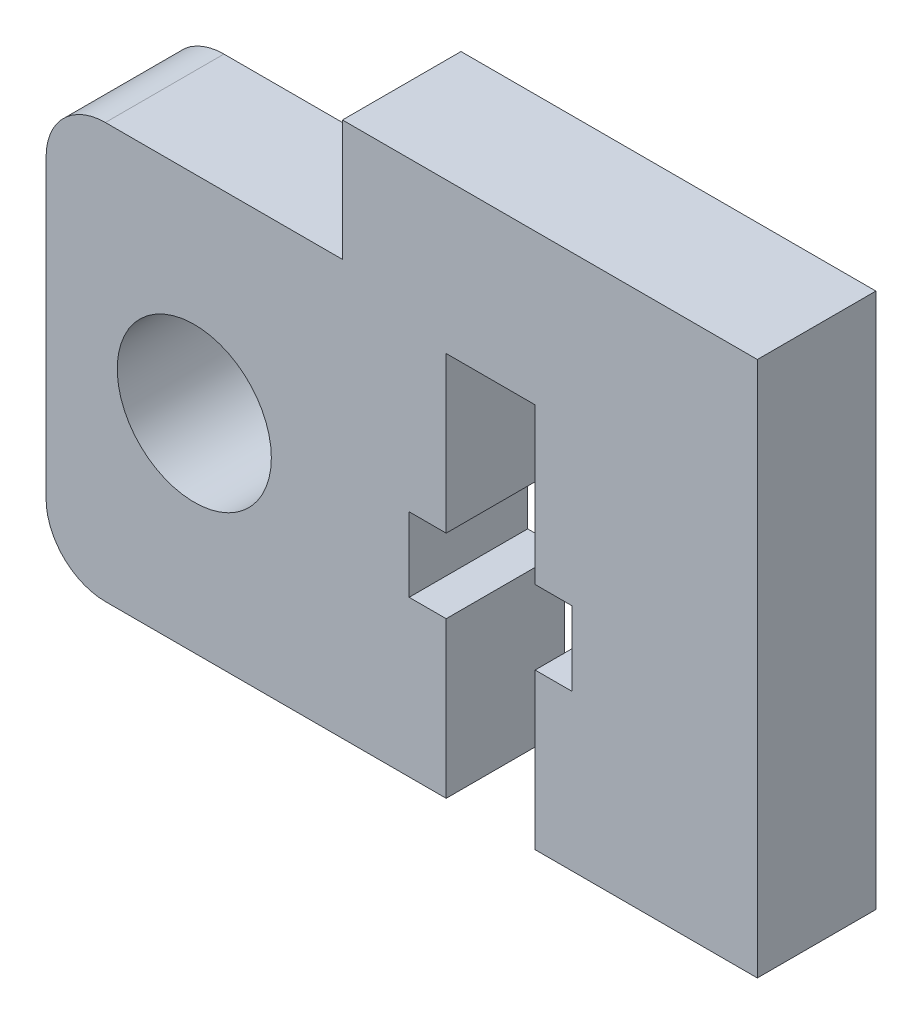
ISO-10303-21;
HEADER;
FILE_DESCRIPTION(('STEP AP214'),'2;1');
FILE_NAME('part.step','',(''),(''),'','','');
FILE_SCHEMA(('AUTOMOTIVE_DESIGN { 1 0 10303 214 1 1 1 1 }'));
ENDSEC;
DATA;
#1=APPLICATION_CONTEXT('core data for automotive mechanical design processes');
#2=APPLICATION_PROTOCOL_DEFINITION('international standard','automotive_design',2000,#1);
#3=PRODUCT_CONTEXT('',#1,'mechanical');
#4=PRODUCT('Part','Part','',(#3));
#5=PRODUCT_RELATED_PRODUCT_CATEGORY('part','',(#4));
#6=PRODUCT_DEFINITION_FORMATION('','',#4);
#7=PRODUCT_DEFINITION_CONTEXT('part definition',#1,'design');
#8=PRODUCT_DEFINITION('design','',#6,#7);
#9=PRODUCT_DEFINITION_SHAPE('','',#8);
#10=(LENGTH_UNIT() NAMED_UNIT(*) SI_UNIT(.MILLI.,.METRE.));
#11=(NAMED_UNIT(*) PLANE_ANGLE_UNIT() SI_UNIT($,.RADIAN.));
#12=(NAMED_UNIT(*) SI_UNIT($,.STERADIAN.) SOLID_ANGLE_UNIT());
#13=UNCERTAINTY_MEASURE_WITH_UNIT(LENGTH_MEASURE(1.E-05),#10,'distance_accuracy_value','');
#14=(GEOMETRIC_REPRESENTATION_CONTEXT(3) GLOBAL_UNCERTAINTY_ASSIGNED_CONTEXT((#13)) GLOBAL_UNIT_ASSIGNED_CONTEXT((#10,
#11,#12)) REPRESENTATION_CONTEXT('',''));
#15=CARTESIAN_POINT('',(0.,0.,0.));
#16=DIRECTION('',(0.,0.,1.));
#17=DIRECTION('',(1.,0.,0.));
#18=AXIS2_PLACEMENT_3D('',#15,#16,#17);
#19=CARTESIAN_POINT('',(5.,18.0746741905259,4.));
#20=DIRECTION('',(0.,-1.,0.));
#21=DIRECTION('',(1.,0.,0.));
#22=AXIS2_PLACEMENT_3D('',#19,#20,#21);
#23=PLANE('',#22);
#24=DIRECTION('',(-1.,0.,0.));
#25=VECTOR('',#24,1.);
#26=CARTESIAN_POINT('',(5.,18.0746741905259,0.));
#27=LINE('',#26,#25);
#28=CARTESIAN_POINT('',(14.,18.0746741905259,0.));
#29=VERTEX_POINT('',#28);
#30=CARTESIAN_POINT('',(0.,18.0746741905259,0.));
#31=VERTEX_POINT('',#30);
#32=EDGE_CURVE('E129',#29,#31,#27,.T.);
#33=ORIENTED_EDGE('',*,*,#32,.T.);
#34=DIRECTION('',(0.,0.,-1.));
#35=VECTOR('',#34,1.);
#36=CARTESIAN_POINT('',(0.,18.0746741905259,4.));
#37=LINE('',#36,#35);
#38=CARTESIAN_POINT('',(0.,18.0746741905259,4.));
#39=VERTEX_POINT('',#38);
#40=EDGE_CURVE('E11',#39,#31,#37,.T.);
#41=ORIENTED_EDGE('',*,*,#40,.F.);
#42=DIRECTION('',(1.,0.,0.));
#43=VECTOR('',#42,1.);
#44=CARTESIAN_POINT('',(5.,18.0746741905259,4.));
#45=LINE('',#44,#43);
#46=CARTESIAN_POINT('',(14.,18.0746741905259,4.));
#47=VERTEX_POINT('',#46);
#48=EDGE_CURVE('E59',#39,#47,#45,.T.);
#49=ORIENTED_EDGE('',*,*,#48,.T.);
#50=DIRECTION('',(0.,0.,-1.));
#51=VECTOR('',#50,1.);
#52=CARTESIAN_POINT('',(14.,18.0746741905259,4.));
#53=LINE('',#52,#51);
#54=EDGE_CURVE('E209',#47,#29,#53,.T.);
#55=ORIENTED_EDGE('',*,*,#54,.T.);
#56=EDGE_LOOP('',(#33,#41,#49,#55));
#57=FACE_BOUND('',#56,.T.);
#58=ADVANCED_FACE('F39',(#57),#23,.F.);
#59=CARTESIAN_POINT('',(0.,18.0746741905259,4.));
#60=DIRECTION('',(1.,0.,0.));
#61=DIRECTION('',(0.,1.,0.));
#62=AXIS2_PLACEMENT_3D('',#59,#60,#61);
#63=PLANE('',#62);
#64=DIRECTION('',(0.,-1.,0.));
#65=VECTOR('',#64,1.);
#66=CARTESIAN_POINT('',(0.,18.0746741905259,0.));
#67=LINE('',#66,#65);
#68=CARTESIAN_POINT('',(0.,14.,0.));
#69=VERTEX_POINT('',#68);
#70=EDGE_CURVE('E273',#31,#69,#67,.T.);
#71=ORIENTED_EDGE('',*,*,#70,.T.);
#72=DIRECTION('',(0.,0.,-1.));
#73=VECTOR('',#72,1.);
#74=CARTESIAN_POINT('',(0.,14.,4.));
#75=LINE('',#74,#73);
#76=CARTESIAN_POINT('',(0.,14.,4.));
#77=VERTEX_POINT('',#76);
#78=EDGE_CURVE('E50',#77,#69,#75,.T.);
#79=ORIENTED_EDGE('',*,*,#78,.F.);
#80=DIRECTION('',(0.,-1.,0.));
#81=VECTOR('',#80,1.);
#82=CARTESIAN_POINT('',(0.,18.0746741905259,4.));
#83=LINE('',#82,#81);
#84=EDGE_CURVE('E205',#39,#77,#83,.T.);
#85=ORIENTED_EDGE('',*,*,#84,.F.);
#86=ORIENTED_EDGE('',*,*,#40,.T.);
#87=EDGE_LOOP('',(#71,#79,#85,#86));
#88=FACE_BOUND('',#87,.T.);
#89=ADVANCED_FACE('F345',(#88),#63,.F.);
#90=CARTESIAN_POINT('',(-8.,14.,4.));
#91=DIRECTION('',(0.,1.,0.));
#92=DIRECTION('',(0.,0.,1.));
#93=AXIS2_PLACEMENT_3D('',#90,#91,#92);
#94=PLANE('',#93);
#95=DIRECTION('',(1.,0.,0.));
#96=VECTOR('',#95,1.);
#97=CARTESIAN_POINT('',(-8.,14.,0.));
#98=LINE('',#97,#96);
#99=CARTESIAN_POINT('',(-8.,14.,0.));
#100=VERTEX_POINT('',#99);
#101=EDGE_CURVE('E189',#100,#69,#98,.T.);
#102=ORIENTED_EDGE('',*,*,#101,.F.);
#103=DIRECTION('',(0.,0.,-1.));
#104=VECTOR('',#103,1.);
#105=CARTESIAN_POINT('',(-8.,14.,4.));
#106=LINE('',#105,#104);
#107=CARTESIAN_POINT('',(-8.,14.,4.));
#108=VERTEX_POINT('',#107);
#109=EDGE_CURVE('E183',#108,#100,#106,.T.);
#110=ORIENTED_EDGE('',*,*,#109,.F.);
#111=DIRECTION('',(1.,0.,0.));
#112=VECTOR('',#111,1.);
#113=CARTESIAN_POINT('',(-8.,14.,4.));
#114=LINE('',#113,#112);
#115=EDGE_CURVE('E187',#108,#77,#114,.T.);
#116=ORIENTED_EDGE('',*,*,#115,.T.);
#117=ORIENTED_EDGE('',*,*,#78,.T.);
#118=EDGE_LOOP('',(#102,#110,#116,#117));
#119=FACE_BOUND('',#118,.T.);
#120=ADVANCED_FACE('F185',(#119),#94,.T.);
#121=CARTESIAN_POINT('',(-8.,12.,4.));
#122=DIRECTION('',(0.,0.,-1.));
#123=DIRECTION('',(-1.,0.,0.));
#124=AXIS2_PLACEMENT_3D('',#121,#122,#123);
#125=CYLINDRICAL_SURFACE('',#124,2.);
#126=CARTESIAN_POINT('',(-8.,12.,0.));
#127=DIRECTION('',(0.,0.,1.));
#128=DIRECTION('',(1.,0.,0.));
#129=AXIS2_PLACEMENT_3D('',#126,#127,#128);
#130=CIRCLE('',#129,2.);
#131=CARTESIAN_POINT('',(-10.,12.,0.));
#132=VERTEX_POINT('',#131);
#133=EDGE_CURVE('E268',#100,#132,#130,.T.);
#134=ORIENTED_EDGE('',*,*,#133,.T.);
#135=DIRECTION('',(0.,0.,-1.));
#136=VECTOR('',#135,1.);
#137=CARTESIAN_POINT('',(-10.,12.,4.));
#138=LINE('',#137,#136);
#139=CARTESIAN_POINT('',(-10.,12.,4.));
#140=VERTEX_POINT('',#139);
#141=EDGE_CURVE('E193',#140,#132,#138,.T.);
#142=ORIENTED_EDGE('',*,*,#141,.F.);
#143=CARTESIAN_POINT('',(-8.,12.,4.));
#144=DIRECTION('',(0.,0.,1.));
#145=DIRECTION('',(1.,0.,0.));
#146=AXIS2_PLACEMENT_3D('',#143,#144,#145);
#147=CIRCLE('',#146,2.);
#148=EDGE_CURVE('E196',#108,#140,#147,.T.);
#149=ORIENTED_EDGE('',*,*,#148,.F.);
#150=ORIENTED_EDGE('',*,*,#109,.T.);
#151=EDGE_LOOP('',(#134,#142,#149,#150));
#152=FACE_BOUND('',#151,.T.);
#153=ADVANCED_FACE('F197',(#152),#125,.T.);
#154=CARTESIAN_POINT('',(-10.,12.,4.));
#155=DIRECTION('',(1.,0.,0.));
#156=DIRECTION('',(0.,0.,-1.));
#157=AXIS2_PLACEMENT_3D('',#154,#155,#156);
#158=PLANE('',#157);
#159=DIRECTION('',(0.,-1.,0.));
#160=VECTOR('',#159,1.);
#161=CARTESIAN_POINT('',(-10.,12.,0.));
#162=LINE('',#161,#160);
#163=CARTESIAN_POINT('',(-10.,2.00000000000001,0.));
#164=VERTEX_POINT('',#163);
#165=EDGE_CURVE('E265',#132,#164,#162,.T.);
#166=ORIENTED_EDGE('',*,*,#165,.T.);
#167=DIRECTION('',(0.,0.,-1.));
#168=VECTOR('',#167,1.);
#169=CARTESIAN_POINT('',(-10.,2.00000000000001,4.));
#170=LINE('',#169,#168);
#171=CARTESIAN_POINT('',(-10.,2.00000000000001,4.));
#172=VERTEX_POINT('',#171);
#173=EDGE_CURVE('E282',#172,#164,#170,.T.);
#174=ORIENTED_EDGE('',*,*,#173,.F.);
#175=DIRECTION('',(0.,-1.,0.));
#176=VECTOR('',#175,1.);
#177=CARTESIAN_POINT('',(-10.,12.,4.));
#178=LINE('',#177,#176);
#179=EDGE_CURVE('E201',#140,#172,#178,.T.);
#180=ORIENTED_EDGE('',*,*,#179,.F.);
#181=ORIENTED_EDGE('',*,*,#141,.T.);
#182=EDGE_LOOP('',(#166,#174,#180,#181));
#183=FACE_BOUND('',#182,.T.);
#184=ADVANCED_FACE('F358',(#183),#158,.F.);
#185=CARTESIAN_POINT('',(-8.,2.,4.));
#186=DIRECTION('',(0.,0.,-1.));
#187=DIRECTION('',(-1.,0.,0.));
#188=AXIS2_PLACEMENT_3D('',#185,#186,#187);
#189=CYLINDRICAL_SURFACE('',#188,2.);
#190=CARTESIAN_POINT('',(-8.,2.,0.));
#191=DIRECTION('',(0.,0.,1.));
#192=DIRECTION('',(1.,0.,0.));
#193=AXIS2_PLACEMENT_3D('',#190,#191,#192);
#194=CIRCLE('',#193,2.);
#195=CARTESIAN_POINT('',(-7.99999999999999,0.,0.));
#196=VERTEX_POINT('',#195);
#197=EDGE_CURVE('E262',#164,#196,#194,.T.);
#198=ORIENTED_EDGE('',*,*,#197,.T.);
#199=DIRECTION('',(0.,0.,-1.));
#200=VECTOR('',#199,1.);
#201=CARTESIAN_POINT('',(-7.99999999999999,0.,4.));
#202=LINE('',#201,#200);
#203=CARTESIAN_POINT('',(-7.99999999999999,0.,4.));
#204=VERTEX_POINT('',#203);
#205=EDGE_CURVE('E286',#204,#196,#202,.T.);
#206=ORIENTED_EDGE('',*,*,#205,.F.);
#207=CARTESIAN_POINT('',(-8.,2.,4.));
#208=DIRECTION('',(0.,0.,1.));
#209=DIRECTION('',(1.,0.,0.));
#210=AXIS2_PLACEMENT_3D('',#207,#208,#209);
#211=CIRCLE('',#210,2.);
#212=EDGE_CURVE('E470',#172,#204,#211,.T.);
#213=ORIENTED_EDGE('',*,*,#212,.F.);
#214=ORIENTED_EDGE('',*,*,#173,.T.);
#215=EDGE_LOOP('',(#198,#206,#213,#214));
#216=FACE_BOUND('',#215,.T.);
#217=ADVANCED_FACE('F361',(#216),#189,.T.);
#218=CARTESIAN_POINT('',(-7.99999999999999,0.,4.));
#219=DIRECTION('',(0.,1.,0.));
#220=DIRECTION('',(0.,0.,1.));
#221=AXIS2_PLACEMENT_3D('',#218,#219,#220);
#222=PLANE('',#221);
#223=DIRECTION('',(1.,0.,0.));
#224=VECTOR('',#223,1.);
#225=CARTESIAN_POINT('',(-7.99999999999999,0.,0.));
#226=LINE('',#225,#224);
#227=CARTESIAN_POINT('',(3.5,0.,0.));
#228=VERTEX_POINT('',#227);
#229=EDGE_CURVE('E259',#196,#228,#226,.T.);
#230=ORIENTED_EDGE('',*,*,#229,.T.);
#231=DIRECTION('',(0.,0.,-1.));
#232=VECTOR('',#231,1.);
#233=CARTESIAN_POINT('',(3.5,0.,4.));
#234=LINE('',#233,#232);
#235=CARTESIAN_POINT('',(3.5,0.,4.));
#236=VERTEX_POINT('',#235);
#237=EDGE_CURVE('E290',#236,#228,#234,.T.);
#238=ORIENTED_EDGE('',*,*,#237,.F.);
#239=DIRECTION('',(1.,0.,0.));
#240=VECTOR('',#239,1.);
#241=CARTESIAN_POINT('',(0.,0.,4.));
#242=LINE('',#241,#240);
#243=EDGE_CURVE('E466',#204,#236,#242,.T.);
#244=ORIENTED_EDGE('',*,*,#243,.F.);
#245=ORIENTED_EDGE('',*,*,#205,.T.);
#246=EDGE_LOOP('',(#230,#238,#244,#245));
#247=FACE_BOUND('',#246,.T.);
#248=ADVANCED_FACE('F365',(#247),#222,.F.);
#249=CARTESIAN_POINT('',(3.5,0.,4.));
#250=DIRECTION('',(-1.,0.,0.));
#251=DIRECTION('',(0.,0.,1.));
#252=AXIS2_PLACEMENT_3D('',#249,#250,#251);
#253=PLANE('',#252);
#254=DIRECTION('',(0.,1.,0.));
#255=VECTOR('',#254,1.);
#256=CARTESIAN_POINT('',(3.5,0.,0.));
#257=LINE('',#256,#255);
#258=CARTESIAN_POINT('',(3.5,5.25,0.));
#259=VERTEX_POINT('',#258);
#260=EDGE_CURVE('E256',#228,#259,#257,.T.);
#261=ORIENTED_EDGE('',*,*,#260,.T.);
#262=DIRECTION('',(0.,0.,-1.));
#263=VECTOR('',#262,1.);
#264=CARTESIAN_POINT('',(3.5,5.25,4.));
#265=LINE('',#264,#263);
#266=CARTESIAN_POINT('',(3.5,5.25,4.));
#267=VERTEX_POINT('',#266);
#268=EDGE_CURVE('E294',#267,#259,#265,.T.);
#269=ORIENTED_EDGE('',*,*,#268,.F.);
#270=DIRECTION('',(0.,1.,0.));
#271=VECTOR('',#270,1.);
#272=CARTESIAN_POINT('',(3.5,0.,4.));
#273=LINE('',#272,#271);
#274=EDGE_CURVE('E465',#236,#267,#273,.T.);
#275=ORIENTED_EDGE('',*,*,#274,.F.);
#276=ORIENTED_EDGE('',*,*,#237,.T.);
#277=EDGE_LOOP('',(#261,#269,#275,#276));
#278=FACE_BOUND('',#277,.T.);
#279=ADVANCED_FACE('F369',(#278),#253,.F.);
#280=CARTESIAN_POINT('',(3.5,5.25,4.));
#281=DIRECTION('',(0.,-1.,0.));
#282=DIRECTION('',(0.,0.,-1.));
#283=AXIS2_PLACEMENT_3D('',#280,#281,#282);
#284=PLANE('',#283);
#285=DIRECTION('',(-1.,0.,0.));
#286=VECTOR('',#285,1.);
#287=CARTESIAN_POINT('',(3.5,5.25,0.));
#288=LINE('',#287,#286);
#289=CARTESIAN_POINT('',(2.25,5.25,0.));
#290=VERTEX_POINT('',#289);
#291=EDGE_CURVE('E253',#259,#290,#288,.T.);
#292=ORIENTED_EDGE('',*,*,#291,.T.);
#293=DIRECTION('',(0.,0.,-1.));
#294=VECTOR('',#293,1.);
#295=CARTESIAN_POINT('',(2.25,5.25,4.));
#296=LINE('',#295,#294);
#297=CARTESIAN_POINT('',(2.25,5.25,4.));
#298=VERTEX_POINT('',#297);
#299=EDGE_CURVE('E298',#298,#290,#296,.T.);
#300=ORIENTED_EDGE('',*,*,#299,.F.);
#301=DIRECTION('',(-1.,0.,0.));
#302=VECTOR('',#301,1.);
#303=CARTESIAN_POINT('',(3.5,5.25,4.));
#304=LINE('',#303,#302);
#305=EDGE_CURVE('E458',#267,#298,#304,.T.);
#306=ORIENTED_EDGE('',*,*,#305,.F.);
#307=ORIENTED_EDGE('',*,*,#268,.T.);
#308=EDGE_LOOP('',(#292,#300,#306,#307));
#309=FACE_BOUND('',#308,.T.);
#310=ADVANCED_FACE('F373',(#309),#284,.F.);
#311=CARTESIAN_POINT('',(2.25,5.25,4.));
#312=DIRECTION('',(-1.,0.,0.));
#313=DIRECTION('',(0.,0.,1.));
#314=AXIS2_PLACEMENT_3D('',#311,#312,#313);
#315=PLANE('',#314);
#316=DIRECTION('',(0.,1.,0.));
#317=VECTOR('',#316,1.);
#318=CARTESIAN_POINT('',(2.25,5.25,0.));
#319=LINE('',#318,#317);
#320=CARTESIAN_POINT('',(2.25,7.75,0.));
#321=VERTEX_POINT('',#320);
#322=EDGE_CURVE('E250',#290,#321,#319,.T.);
#323=ORIENTED_EDGE('',*,*,#322,.T.);
#324=DIRECTION('',(0.,0.,-1.));
#325=VECTOR('',#324,1.);
#326=CARTESIAN_POINT('',(2.25,7.75,4.));
#327=LINE('',#326,#325);
#328=CARTESIAN_POINT('',(2.25,7.75,4.));
#329=VERTEX_POINT('',#328);
#330=EDGE_CURVE('E302',#329,#321,#327,.T.);
#331=ORIENTED_EDGE('',*,*,#330,.F.);
#332=DIRECTION('',(0.,1.,0.));
#333=VECTOR('',#332,1.);
#334=CARTESIAN_POINT('',(2.25,5.25,4.));
#335=LINE('',#334,#333);
#336=EDGE_CURVE('E455',#298,#329,#335,.T.);
#337=ORIENTED_EDGE('',*,*,#336,.F.);
#338=ORIENTED_EDGE('',*,*,#299,.T.);
#339=EDGE_LOOP('',(#323,#331,#337,#338));
#340=FACE_BOUND('',#339,.T.);
#341=ADVANCED_FACE('F377',(#340),#315,.F.);
#342=CARTESIAN_POINT('',(2.25,7.75,4.));
#343=DIRECTION('',(0.,1.,0.));
#344=DIRECTION('',(0.,0.,1.));
#345=AXIS2_PLACEMENT_3D('',#342,#343,#344);
#346=PLANE('',#345);
#347=DIRECTION('',(1.,0.,0.));
#348=VECTOR('',#347,1.);
#349=CARTESIAN_POINT('',(2.25,7.75,0.));
#350=LINE('',#349,#348);
#351=CARTESIAN_POINT('',(3.5,7.75,0.));
#352=VERTEX_POINT('',#351);
#353=EDGE_CURVE('E247',#321,#352,#350,.T.);
#354=ORIENTED_EDGE('',*,*,#353,.T.);
#355=DIRECTION('',(0.,0.,-1.));
#356=VECTOR('',#355,1.);
#357=CARTESIAN_POINT('',(3.5,7.75,4.));
#358=LINE('',#357,#356);
#359=CARTESIAN_POINT('',(3.5,7.75,4.));
#360=VERTEX_POINT('',#359);
#361=EDGE_CURVE('E306',#360,#352,#358,.T.);
#362=ORIENTED_EDGE('',*,*,#361,.F.);
#363=DIRECTION('',(1.,0.,0.));
#364=VECTOR('',#363,1.);
#365=CARTESIAN_POINT('',(2.25,7.75,4.));
#366=LINE('',#365,#364);
#367=EDGE_CURVE('E453',#329,#360,#366,.T.);
#368=ORIENTED_EDGE('',*,*,#367,.F.);
#369=ORIENTED_EDGE('',*,*,#330,.T.);
#370=EDGE_LOOP('',(#354,#362,#368,#369));
#371=FACE_BOUND('',#370,.T.);
#372=ADVANCED_FACE('F381',(#371),#346,.F.);
#373=CARTESIAN_POINT('',(3.5,7.75,4.));
#374=DIRECTION('',(-1.,0.,0.));
#375=DIRECTION('',(0.,0.,1.));
#376=AXIS2_PLACEMENT_3D('',#373,#374,#375);
#377=PLANE('',#376);
#378=DIRECTION('',(0.,1.,0.));
#379=VECTOR('',#378,1.);
#380=CARTESIAN_POINT('',(3.5,7.75,0.));
#381=LINE('',#380,#379);
#382=CARTESIAN_POINT('',(3.5,13.,0.));
#383=VERTEX_POINT('',#382);
#384=EDGE_CURVE('E244',#352,#383,#381,.T.);
#385=ORIENTED_EDGE('',*,*,#384,.T.);
#386=DIRECTION('',(0.,0.,-1.));
#387=VECTOR('',#386,1.);
#388=CARTESIAN_POINT('',(3.5,13.,4.));
#389=LINE('',#388,#387);
#390=CARTESIAN_POINT('',(3.5,13.,4.));
#391=VERTEX_POINT('',#390);
#392=EDGE_CURVE('E310',#391,#383,#389,.T.);
#393=ORIENTED_EDGE('',*,*,#392,.F.);
#394=DIRECTION('',(0.,1.,0.));
#395=VECTOR('',#394,1.);
#396=CARTESIAN_POINT('',(3.5,7.75,4.));
#397=LINE('',#396,#395);
#398=EDGE_CURVE('E446',#360,#391,#397,.T.);
#399=ORIENTED_EDGE('',*,*,#398,.F.);
#400=ORIENTED_EDGE('',*,*,#361,.T.);
#401=EDGE_LOOP('',(#385,#393,#399,#400));
#402=FACE_BOUND('',#401,.T.);
#403=ADVANCED_FACE('F385',(#402),#377,.F.);
#404=CARTESIAN_POINT('',(3.5,13.,4.));
#405=DIRECTION('',(0.,1.,0.));
#406=DIRECTION('',(0.,0.,1.));
#407=AXIS2_PLACEMENT_3D('',#404,#405,#406);
#408=PLANE('',#407);
#409=DIRECTION('',(1.,0.,0.));
#410=VECTOR('',#409,1.);
#411=CARTESIAN_POINT('',(3.5,13.,0.));
#412=LINE('',#411,#410);
#413=CARTESIAN_POINT('',(6.5,13.,0.));
#414=VERTEX_POINT('',#413);
#415=EDGE_CURVE('E240',#383,#414,#412,.T.);
#416=ORIENTED_EDGE('',*,*,#415,.T.);
#417=DIRECTION('',(0.,0.,-1.));
#418=VECTOR('',#417,1.);
#419=CARTESIAN_POINT('',(6.5,13.,4.));
#420=LINE('',#419,#418);
#421=CARTESIAN_POINT('',(6.5,13.,4.));
#422=VERTEX_POINT('',#421);
#423=EDGE_CURVE('E314',#422,#414,#420,.T.);
#424=ORIENTED_EDGE('',*,*,#423,.F.);
#425=DIRECTION('',(1.,0.,0.));
#426=VECTOR('',#425,1.);
#427=CARTESIAN_POINT('',(3.5,13.,4.));
#428=LINE('',#427,#426);
#429=EDGE_CURVE('E444',#391,#422,#428,.T.);
#430=ORIENTED_EDGE('',*,*,#429,.F.);
#431=ORIENTED_EDGE('',*,*,#392,.T.);
#432=EDGE_LOOP('',(#416,#424,#430,#431));
#433=FACE_BOUND('',#432,.T.);
#434=ADVANCED_FACE('F389',(#433),#408,.F.);
#435=CARTESIAN_POINT('',(6.5,7.75,4.));
#436=DIRECTION('',(-1.,0.,0.));
#437=DIRECTION('',(0.,-1.,0.));
#438=AXIS2_PLACEMENT_3D('',#435,#436,#437);
#439=PLANE('',#438);
#440=DIRECTION('',(0.,1.,0.));
#441=VECTOR('',#440,1.);
#442=CARTESIAN_POINT('',(6.5,7.75,0.));
#443=LINE('',#442,#441);
#444=CARTESIAN_POINT('',(6.5,7.75,0.));
#445=VERTEX_POINT('',#444);
#446=EDGE_CURVE('E236',#445,#414,#443,.T.);
#447=ORIENTED_EDGE('',*,*,#446,.F.);
#448=DIRECTION('',(0.,0.,-1.));
#449=VECTOR('',#448,1.);
#450=CARTESIAN_POINT('',(6.5,7.75,4.));
#451=LINE('',#450,#449);
#452=CARTESIAN_POINT('',(6.5,7.75,4.));
#453=VERTEX_POINT('',#452);
#454=EDGE_CURVE('E317',#453,#445,#451,.T.);
#455=ORIENTED_EDGE('',*,*,#454,.F.);
#456=DIRECTION('',(0.,1.,0.));
#457=VECTOR('',#456,1.);
#458=CARTESIAN_POINT('',(6.5,7.75,4.));
#459=LINE('',#458,#457);
#460=EDGE_CURVE('E441',#453,#422,#459,.T.);
#461=ORIENTED_EDGE('',*,*,#460,.T.);
#462=ORIENTED_EDGE('',*,*,#423,.T.);
#463=EDGE_LOOP('',(#447,#455,#461,#462));
#464=FACE_BOUND('',#463,.T.);
#465=ADVANCED_FACE('F393',(#464),#439,.T.);
#466=CARTESIAN_POINT('',(7.75,7.75,4.));
#467=DIRECTION('',(0.,-1.,0.));
#468=DIRECTION('',(1.,0.,0.));
#469=AXIS2_PLACEMENT_3D('',#466,#467,#468);
#470=PLANE('',#469);
#471=DIRECTION('',(-1.,0.,0.));
#472=VECTOR('',#471,1.);
#473=CARTESIAN_POINT('',(7.75,7.75,0.));
#474=LINE('',#473,#472);
#475=CARTESIAN_POINT('',(7.75,7.75,0.));
#476=VERTEX_POINT('',#475);
#477=EDGE_CURVE('E232',#476,#445,#474,.T.);
#478=ORIENTED_EDGE('',*,*,#477,.F.);
#479=DIRECTION('',(0.,0.,-1.));
#480=VECTOR('',#479,1.);
#481=CARTESIAN_POINT('',(7.75,7.75,4.));
#482=LINE('',#481,#480);
#483=CARTESIAN_POINT('',(7.75,7.75,4.));
#484=VERTEX_POINT('',#483);
#485=EDGE_CURVE('E320',#484,#476,#482,.T.);
#486=ORIENTED_EDGE('',*,*,#485,.F.);
#487=DIRECTION('',(-1.,0.,0.));
#488=VECTOR('',#487,1.);
#489=CARTESIAN_POINT('',(7.75,7.75,4.));
#490=LINE('',#489,#488);
#491=EDGE_CURVE('E493',#484,#453,#490,.T.);
#492=ORIENTED_EDGE('',*,*,#491,.T.);
#493=ORIENTED_EDGE('',*,*,#454,.T.);
#494=EDGE_LOOP('',(#478,#486,#492,#493));
#495=FACE_BOUND('',#494,.T.);
#496=ADVANCED_FACE('F397',(#495),#470,.T.);
#497=CARTESIAN_POINT('',(7.75,5.25,4.));
#498=DIRECTION('',(-1.,0.,0.));
#499=DIRECTION('',(0.,-1.,0.));
#500=AXIS2_PLACEMENT_3D('',#497,#498,#499);
#501=PLANE('',#500);
#502=DIRECTION('',(0.,1.,0.));
#503=VECTOR('',#502,1.);
#504=CARTESIAN_POINT('',(7.75,5.25,0.));
#505=LINE('',#504,#503);
#506=CARTESIAN_POINT('',(7.75,5.25,0.));
#507=VERTEX_POINT('',#506);
#508=EDGE_CURVE('E228',#507,#476,#505,.T.);
#509=ORIENTED_EDGE('',*,*,#508,.F.);
#510=DIRECTION('',(0.,0.,-1.));
#511=VECTOR('',#510,1.);
#512=CARTESIAN_POINT('',(7.75,5.25,4.));
#513=LINE('',#512,#511);
#514=CARTESIAN_POINT('',(7.75,5.25,4.));
#515=VERTEX_POINT('',#514);
#516=EDGE_CURVE('E323',#515,#507,#513,.T.);
#517=ORIENTED_EDGE('',*,*,#516,.F.);
#518=DIRECTION('',(0.,1.,0.));
#519=VECTOR('',#518,1.);
#520=CARTESIAN_POINT('',(7.75,5.25,4.));
#521=LINE('',#520,#519);
#522=EDGE_CURVE('E432',#515,#484,#521,.T.);
#523=ORIENTED_EDGE('',*,*,#522,.T.);
#524=ORIENTED_EDGE('',*,*,#485,.T.);
#525=EDGE_LOOP('',(#509,#517,#523,#524));
#526=FACE_BOUND('',#525,.T.);
#527=ADVANCED_FACE('F401',(#526),#501,.T.);
#528=CARTESIAN_POINT('',(6.5,5.25,4.));
#529=DIRECTION('',(0.,1.,0.));
#530=DIRECTION('',(-1.,0.,0.));
#531=AXIS2_PLACEMENT_3D('',#528,#529,#530);
#532=PLANE('',#531);
#533=DIRECTION('',(1.,0.,0.));
#534=VECTOR('',#533,1.);
#535=CARTESIAN_POINT('',(6.5,5.25,0.));
#536=LINE('',#535,#534);
#537=CARTESIAN_POINT('',(6.5,5.25,0.));
#538=VERTEX_POINT('',#537);
#539=EDGE_CURVE('E224',#538,#507,#536,.T.);
#540=ORIENTED_EDGE('',*,*,#539,.F.);
#541=DIRECTION('',(0.,0.,-1.));
#542=VECTOR('',#541,1.);
#543=CARTESIAN_POINT('',(6.5,5.25,4.));
#544=LINE('',#543,#542);
#545=CARTESIAN_POINT('',(6.5,5.25,4.));
#546=VERTEX_POINT('',#545);
#547=EDGE_CURVE('E326',#546,#538,#544,.T.);
#548=ORIENTED_EDGE('',*,*,#547,.F.);
#549=DIRECTION('',(1.,0.,0.));
#550=VECTOR('',#549,1.);
#551=CARTESIAN_POINT('',(6.5,5.25,4.));
#552=LINE('',#551,#550);
#553=EDGE_CURVE('E428',#546,#515,#552,.T.);
#554=ORIENTED_EDGE('',*,*,#553,.T.);
#555=ORIENTED_EDGE('',*,*,#516,.T.);
#556=EDGE_LOOP('',(#540,#548,#554,#555));
#557=FACE_BOUND('',#556,.T.);
#558=ADVANCED_FACE('F405',(#557),#532,.T.);
#559=CARTESIAN_POINT('',(6.5,0.,4.));
#560=DIRECTION('',(-1.,0.,0.));
#561=DIRECTION('',(0.,-1.,0.));
#562=AXIS2_PLACEMENT_3D('',#559,#560,#561);
#563=PLANE('',#562);
#564=DIRECTION('',(0.,1.,0.));
#565=VECTOR('',#564,1.);
#566=CARTESIAN_POINT('',(6.5,0.,0.));
#567=LINE('',#566,#565);
#568=CARTESIAN_POINT('',(6.5,0.,0.));
#569=VERTEX_POINT('',#568);
#570=EDGE_CURVE('E220',#569,#538,#567,.T.);
#571=ORIENTED_EDGE('',*,*,#570,.F.);
#572=DIRECTION('',(0.,0.,-1.));
#573=VECTOR('',#572,1.);
#574=CARTESIAN_POINT('',(6.5,0.,4.));
#575=LINE('',#574,#573);
#576=CARTESIAN_POINT('',(6.5,0.,4.));
#577=VERTEX_POINT('',#576);
#578=EDGE_CURVE('E329',#577,#569,#575,.T.);
#579=ORIENTED_EDGE('',*,*,#578,.F.);
#580=DIRECTION('',(0.,1.,0.));
#581=VECTOR('',#580,1.);
#582=CARTESIAN_POINT('',(6.5,0.,4.));
#583=LINE('',#582,#581);
#584=EDGE_CURVE('E423',#577,#546,#583,.T.);
#585=ORIENTED_EDGE('',*,*,#584,.T.);
#586=ORIENTED_EDGE('',*,*,#547,.T.);
#587=EDGE_LOOP('',(#571,#579,#585,#586));
#588=FACE_BOUND('',#587,.T.);
#589=ADVANCED_FACE('F409',(#588),#563,.T.);
#590=CARTESIAN_POINT('',(6.5,0.,4.));
#591=DIRECTION('',(0.,1.,0.));
#592=DIRECTION('',(-1.,0.,0.));
#593=AXIS2_PLACEMENT_3D('',#590,#591,#592);
#594=PLANE('',#593);
#595=DIRECTION('',(1.,0.,0.));
#596=VECTOR('',#595,1.);
#597=CARTESIAN_POINT('',(6.5,0.,0.));
#598=LINE('',#597,#596);
#599=CARTESIAN_POINT('',(14.,0.,0.));
#600=VERTEX_POINT('',#599);
#601=EDGE_CURVE('E217',#569,#600,#598,.T.);
#602=ORIENTED_EDGE('',*,*,#601,.T.);
#603=DIRECTION('',(0.,0.,-1.));
#604=VECTOR('',#603,1.);
#605=CARTESIAN_POINT('',(14.,0.,4.));
#606=LINE('',#605,#604);
#607=CARTESIAN_POINT('',(14.,0.,4.));
#608=VERTEX_POINT('',#607);
#609=EDGE_CURVE('E332',#608,#600,#606,.T.);
#610=ORIENTED_EDGE('',*,*,#609,.F.);
#611=DIRECTION('',(1.,0.,0.));
#612=VECTOR('',#611,1.);
#613=CARTESIAN_POINT('',(6.5,0.,4.));
#614=LINE('',#613,#612);
#615=EDGE_CURVE('E420',#577,#608,#614,.T.);
#616=ORIENTED_EDGE('',*,*,#615,.F.);
#617=ORIENTED_EDGE('',*,*,#578,.T.);
#618=EDGE_LOOP('',(#602,#610,#616,#617));
#619=FACE_BOUND('',#618,.T.);
#620=ADVANCED_FACE('F412',(#619),#594,.F.);
#621=CARTESIAN_POINT('',(14.,0.,4.));
#622=DIRECTION('',(-1.,0.,0.));
#623=DIRECTION('',(0.,-1.,0.));
#624=AXIS2_PLACEMENT_3D('',#621,#622,#623);
#625=PLANE('',#624);
#626=DIRECTION('',(0.,1.,0.));
#627=VECTOR('',#626,1.);
#628=CARTESIAN_POINT('',(14.,0.,0.));
#629=LINE('',#628,#627);
#630=EDGE_CURVE('E213',#600,#29,#629,.T.);
#631=ORIENTED_EDGE('',*,*,#630,.T.);
#632=ORIENTED_EDGE('',*,*,#54,.F.);
#633=DIRECTION('',(0.,1.,0.));
#634=VECTOR('',#633,1.);
#635=CARTESIAN_POINT('',(14.,0.,4.));
#636=LINE('',#635,#634);
#637=EDGE_CURVE('E134',#608,#47,#636,.T.);
#638=ORIENTED_EDGE('',*,*,#637,.F.);
#639=ORIENTED_EDGE('',*,*,#609,.T.);
#640=EDGE_LOOP('',(#631,#632,#638,#639));
#641=FACE_BOUND('',#640,.T.);
#642=ADVANCED_FACE('F41',(#641),#625,.F.);
#643=CARTESIAN_POINT('',(-8.,2.,4.));
#644=DIRECTION('',(0.,0.,1.));
#645=DIRECTION('',(1.,0.,0.));
#646=AXIS2_PLACEMENT_3D('',#643,#644,#645);
#647=PLANE('',#646);
#648=CARTESIAN_POINT('',(-5.,7.00000000000001,4.));
#649=DIRECTION('',(0.,0.,1.));
#650=DIRECTION('',(1.,0.,0.));
#651=AXIS2_PLACEMENT_3D('',#648,#649,#650);
#652=CIRCLE('',#651,2.6);
#653=CARTESIAN_POINT('',(-2.4,7.00000000000001,4.));
#654=VERTEX_POINT('',#653);
#655=EDGE_CURVE('E508',#654,#654,#652,.T.);
#656=ORIENTED_EDGE('',*,*,#655,.F.);
#657=EDGE_LOOP('',(#656));
#658=FACE_BOUND('',#657,.T.);
#659=ORIENTED_EDGE('',*,*,#48,.F.);
#660=ORIENTED_EDGE('',*,*,#84,.T.);
#661=ORIENTED_EDGE('',*,*,#115,.F.);
#662=ORIENTED_EDGE('',*,*,#148,.T.);
#663=ORIENTED_EDGE('',*,*,#179,.T.);
#664=ORIENTED_EDGE('',*,*,#212,.T.);
#665=ORIENTED_EDGE('',*,*,#243,.T.);
#666=ORIENTED_EDGE('',*,*,#274,.T.);
#667=ORIENTED_EDGE('',*,*,#305,.T.);
#668=ORIENTED_EDGE('',*,*,#336,.T.);
#669=ORIENTED_EDGE('',*,*,#367,.T.);
#670=ORIENTED_EDGE('',*,*,#398,.T.);
#671=ORIENTED_EDGE('',*,*,#429,.T.);
#672=ORIENTED_EDGE('',*,*,#460,.F.);
#673=ORIENTED_EDGE('',*,*,#491,.F.);
#674=ORIENTED_EDGE('',*,*,#522,.F.);
#675=ORIENTED_EDGE('',*,*,#553,.F.);
#676=ORIENTED_EDGE('',*,*,#584,.F.);
#677=ORIENTED_EDGE('',*,*,#615,.T.);
#678=ORIENTED_EDGE('',*,*,#637,.T.);
#679=EDGE_LOOP('',(#659,#660,#661,#662,#663,#664,#665,#666,#667,#668,#669,#670,#671,#672,#673,
#674,#675,#676,#677,#678));
#680=FACE_BOUND('',#679,.T.);
#681=ADVANCED_FACE('F203',(#658,#680),#647,.T.);
#682=CARTESIAN_POINT('',(-8.,2.,0.));
#683=DIRECTION('',(0.,0.,1.));
#684=DIRECTION('',(1.,0.,0.));
#685=AXIS2_PLACEMENT_3D('',#682,#683,#684);
#686=PLANE('',#685);
#687=CARTESIAN_POINT('',(-5.,7.00000000000001,0.));
#688=DIRECTION('',(0.,0.,1.));
#689=DIRECTION('',(1.,0.,0.));
#690=AXIS2_PLACEMENT_3D('',#687,#688,#689);
#691=CIRCLE('',#690,2.6);
#692=CARTESIAN_POINT('',(-2.4,7.00000000000001,0.));
#693=VERTEX_POINT('',#692);
#694=EDGE_CURVE('E43',#693,#693,#691,.T.);
#695=ORIENTED_EDGE('',*,*,#694,.T.);
#696=EDGE_LOOP('',(#695));
#697=FACE_BOUND('',#696,.T.);
#698=ORIENTED_EDGE('',*,*,#32,.F.);
#699=ORIENTED_EDGE('',*,*,#630,.F.);
#700=ORIENTED_EDGE('',*,*,#601,.F.);
#701=ORIENTED_EDGE('',*,*,#570,.T.);
#702=ORIENTED_EDGE('',*,*,#539,.T.);
#703=ORIENTED_EDGE('',*,*,#508,.T.);
#704=ORIENTED_EDGE('',*,*,#477,.T.);
#705=ORIENTED_EDGE('',*,*,#446,.T.);
#706=ORIENTED_EDGE('',*,*,#415,.F.);
#707=ORIENTED_EDGE('',*,*,#384,.F.);
#708=ORIENTED_EDGE('',*,*,#353,.F.);
#709=ORIENTED_EDGE('',*,*,#322,.F.);
#710=ORIENTED_EDGE('',*,*,#291,.F.);
#711=ORIENTED_EDGE('',*,*,#260,.F.);
#712=ORIENTED_EDGE('',*,*,#229,.F.);
#713=ORIENTED_EDGE('',*,*,#197,.F.);
#714=ORIENTED_EDGE('',*,*,#165,.F.);
#715=ORIENTED_EDGE('',*,*,#133,.F.);
#716=ORIENTED_EDGE('',*,*,#101,.T.);
#717=ORIENTED_EDGE('',*,*,#70,.F.);
#718=EDGE_LOOP('',(#698,#699,#700,#701,#702,#703,#704,#705,#706,#707,#708,#709,#710,#711,#712,
#713,#714,#715,#716,#717));
#719=FACE_BOUND('',#718,.T.);
#720=ADVANCED_FACE('F341',(#697,#719),#686,.F.);
#721=CARTESIAN_POINT('',(-5.,7.00000000000001,-6.));
#722=DIRECTION('',(0.,0.,1.));
#723=DIRECTION('',(1.,0.,0.));
#724=AXIS2_PLACEMENT_3D('',#721,#722,#723);
#725=CYLINDRICAL_SURFACE('',#724,2.6);
#726=ORIENTED_EDGE('',*,*,#655,.T.);
#727=EDGE_LOOP('',(#726));
#728=FACE_BOUND('',#727,.T.);
#729=ORIENTED_EDGE('',*,*,#694,.F.);
#730=EDGE_LOOP('',(#729));
#731=FACE_BOUND('',#730,.T.);
#732=ADVANCED_FACE('F518',(#728,#731),#725,.F.);
#733=CLOSED_SHELL('',(#58,#89,#120,#153,#184,#217,#248,#279,#310,#341,#372,#403,#434,#465,#496,
#527,#558,#589,#620,#642,#681,#720,#732));
#734=MANIFOLD_SOLID_BREP('B2',#733);
#735=ADVANCED_BREP_SHAPE_REPRESENTATION('',(#18,#734),#14);
#736=SHAPE_DEFINITION_REPRESENTATION(#9,#735);
ENDSEC;
END-ISO-10303-21;
